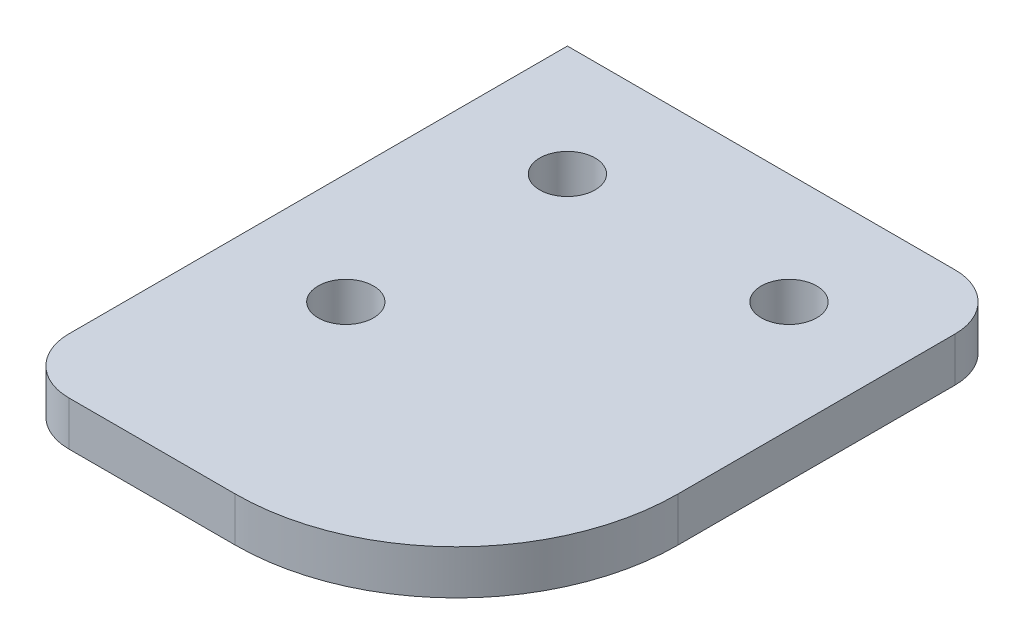
ISO-10303-21;
HEADER;
FILE_DESCRIPTION(('STEP AP214'),'2;1');
FILE_NAME('part.step','',(''),(''),'','','');
FILE_SCHEMA(('AUTOMOTIVE_DESIGN { 1 0 10303 214 1 1 1 1 }'));
ENDSEC;
DATA;
#1=APPLICATION_CONTEXT('core data for automotive mechanical design processes');
#2=APPLICATION_PROTOCOL_DEFINITION('international standard','automotive_design',2000,#1);
#3=PRODUCT_CONTEXT('',#1,'mechanical');
#4=PRODUCT('Part','Part','',(#3));
#5=PRODUCT_RELATED_PRODUCT_CATEGORY('part','',(#4));
#6=PRODUCT_DEFINITION_FORMATION('','',#4);
#7=PRODUCT_DEFINITION_CONTEXT('part definition',#1,'design');
#8=PRODUCT_DEFINITION('design','',#6,#7);
#9=PRODUCT_DEFINITION_SHAPE('','',#8);
#10=(LENGTH_UNIT() NAMED_UNIT(*) SI_UNIT(.MILLI.,.METRE.));
#11=(NAMED_UNIT(*) PLANE_ANGLE_UNIT() SI_UNIT($,.RADIAN.));
#12=(NAMED_UNIT(*) SI_UNIT($,.STERADIAN.) SOLID_ANGLE_UNIT());
#13=UNCERTAINTY_MEASURE_WITH_UNIT(LENGTH_MEASURE(1.E-05),#10,'distance_accuracy_value','');
#14=(GEOMETRIC_REPRESENTATION_CONTEXT(3) GLOBAL_UNCERTAINTY_ASSIGNED_CONTEXT((#13)) GLOBAL_UNIT_ASSIGNED_CONTEXT((#10,
#11,#12)) REPRESENTATION_CONTEXT('',''));
#15=CARTESIAN_POINT('',(0.,0.,0.));
#16=DIRECTION('',(0.,0.,1.));
#17=DIRECTION('',(1.,0.,0.));
#18=AXIS2_PLACEMENT_3D('',#15,#16,#17);
#19=CARTESIAN_POINT('',(0.,4.,10.));
#20=DIRECTION('',(0.,-1.,0.));
#21=DIRECTION('',(0.,0.,-1.));
#22=AXIS2_PLACEMENT_3D('',#19,#20,#21);
#23=PLANE('',#22);
#24=DIRECTION('',(0.,0.,-1.));
#25=VECTOR('',#24,1.);
#26=CARTESIAN_POINT('',(20.,4.,-20.));
#27=LINE('',#26,#25);
#28=CARTESIAN_POINT('',(20.,4.,10.));
#29=VERTEX_POINT('',#28);
#30=CARTESIAN_POINT('',(20.,4.,-15.));
#31=VERTEX_POINT('',#30);
#32=EDGE_CURVE('E129',#29,#31,#27,.T.);
#33=ORIENTED_EDGE('',*,*,#32,.T.);
#34=CARTESIAN_POINT('',(15.,4.,-15.));
#35=DIRECTION('',(0.,-1.,0.));
#36=DIRECTION('',(0.,0.,-1.));
#37=AXIS2_PLACEMENT_3D('',#34,#35,#36);
#38=CIRCLE('',#37,5.);
#39=CARTESIAN_POINT('',(15.,4.,-20.));
#40=VERTEX_POINT('',#39);
#41=EDGE_CURVE('E185',#31,#40,#38,.F.);
#42=ORIENTED_EDGE('',*,*,#41,.T.);
#43=DIRECTION('',(-1.,0.,0.));
#44=VECTOR('',#43,1.);
#45=CARTESIAN_POINT('',(-20.,4.,-20.));
#46=LINE('',#45,#44);
#47=CARTESIAN_POINT('',(-20.,4.,-20.));
#48=VERTEX_POINT('',#47);
#49=EDGE_CURVE('E131',#40,#48,#46,.T.);
#50=ORIENTED_EDGE('',*,*,#49,.T.);
#51=DIRECTION('',(0.,0.,1.));
#52=VECTOR('',#51,1.);
#53=CARTESIAN_POINT('',(-20.,4.,-20.));
#54=LINE('',#53,#52);
#55=CARTESIAN_POINT('',(-20.,4.,25.));
#56=VERTEX_POINT('',#55);
#57=EDGE_CURVE('E114',#48,#56,#54,.T.);
#58=ORIENTED_EDGE('',*,*,#57,.T.);
#59=CARTESIAN_POINT('',(-15.,4.,25.));
#60=DIRECTION('',(0.,-1.,0.));
#61=DIRECTION('',(0.,0.,-1.));
#62=AXIS2_PLACEMENT_3D('',#59,#60,#61);
#63=CIRCLE('',#62,5.);
#64=CARTESIAN_POINT('',(-15.,4.,30.));
#65=VERTEX_POINT('',#64);
#66=EDGE_CURVE('E62',#56,#65,#63,.F.);
#67=ORIENTED_EDGE('',*,*,#66,.T.);
#68=DIRECTION('',(1.,0.,0.));
#69=VECTOR('',#68,1.);
#70=CARTESIAN_POINT('',(-20.,4.,30.));
#71=LINE('',#70,#69);
#72=CARTESIAN_POINT('',(0.,4.,30.));
#73=VERTEX_POINT('',#72);
#74=EDGE_CURVE('E103',#65,#73,#71,.T.);
#75=ORIENTED_EDGE('',*,*,#74,.T.);
#76=CARTESIAN_POINT('',(0.,4.,10.));
#77=DIRECTION('',(0.,1.,0.));
#78=DIRECTION('',(0.,0.,-1.));
#79=AXIS2_PLACEMENT_3D('',#76,#77,#78);
#80=CIRCLE('',#79,20.);
#81=EDGE_CURVE('E109',#73,#29,#80,.T.);
#82=ORIENTED_EDGE('',*,*,#81,.T.);
#83=EDGE_LOOP('',(#33,#42,#50,#58,#67,#75,#82));
#84=FACE_BOUND('',#83,.T.);
#85=CARTESIAN_POINT('',(-9.99999999999999,4.,-9.99999999999999));
#86=DIRECTION('',(0.,1.,0.));
#87=DIRECTION('',(0.,0.,1.));
#88=AXIS2_PLACEMENT_3D('',#85,#86,#87);
#89=CIRCLE('',#88,2.5);
#90=CARTESIAN_POINT('',(-9.99999999999999,4.,-7.49999999999999));
#91=VERTEX_POINT('',#90);
#92=EDGE_CURVE('E141',#91,#91,#89,.T.);
#93=ORIENTED_EDGE('',*,*,#92,.F.);
#94=EDGE_LOOP('',(#93));
#95=FACE_BOUND('',#94,.T.);
#96=CARTESIAN_POINT('',(9.99999999999999,4.,-9.99999999999999));
#97=DIRECTION('',(0.,1.,0.));
#98=DIRECTION('',(0.,0.,-1.));
#99=AXIS2_PLACEMENT_3D('',#96,#97,#98);
#100=CIRCLE('',#99,2.5);
#101=CARTESIAN_POINT('',(9.99999999999999,4.,-12.5));
#102=VERTEX_POINT('',#101);
#103=EDGE_CURVE('E154',#102,#102,#100,.T.);
#104=ORIENTED_EDGE('',*,*,#103,.F.);
#105=EDGE_LOOP('',(#104));
#106=FACE_BOUND('',#105,.T.);
#107=CARTESIAN_POINT('',(-9.99999999999999,4.,9.99999999999999));
#108=DIRECTION('',(0.,1.,0.));
#109=DIRECTION('',(0.,0.,-1.));
#110=AXIS2_PLACEMENT_3D('',#107,#108,#109);
#111=CIRCLE('',#110,2.5);
#112=CARTESIAN_POINT('',(-9.99999999999999,4.,7.49999999999999));
#113=VERTEX_POINT('',#112);
#114=EDGE_CURVE('E155',#113,#113,#111,.T.);
#115=ORIENTED_EDGE('',*,*,#114,.F.);
#116=EDGE_LOOP('',(#115));
#117=FACE_BOUND('',#116,.T.);
#118=ADVANCED_FACE('F47',(#84,#95,#106,#117),#23,.F.);
#119=CARTESIAN_POINT('',(0.,0.,10.));
#120=DIRECTION('',(0.,-1.,0.));
#121=DIRECTION('',(0.,0.,-1.));
#122=AXIS2_PLACEMENT_3D('',#119,#120,#121);
#123=PLANE('',#122);
#124=CARTESIAN_POINT('',(9.99999999999999,0.,-9.99999999999999));
#125=DIRECTION('',(0.,1.,0.));
#126=DIRECTION('',(0.,0.,-1.));
#127=AXIS2_PLACEMENT_3D('',#124,#125,#126);
#128=CIRCLE('',#127,2.5);
#129=CARTESIAN_POINT('',(9.99999999999999,0.,-12.5));
#130=VERTEX_POINT('',#129);
#131=EDGE_CURVE('E148',#130,#130,#128,.T.);
#132=ORIENTED_EDGE('',*,*,#131,.T.);
#133=EDGE_LOOP('',(#132));
#134=FACE_BOUND('',#133,.T.);
#135=DIRECTION('',(-1.,0.,0.));
#136=VECTOR('',#135,1.);
#137=CARTESIAN_POINT('',(-20.,0.,-20.));
#138=LINE('',#137,#136);
#139=CARTESIAN_POINT('',(15.,0.,-20.));
#140=VERTEX_POINT('',#139);
#141=CARTESIAN_POINT('',(-20.,0.,-20.));
#142=VERTEX_POINT('',#141);
#143=EDGE_CURVE('E162',#140,#142,#138,.T.);
#144=ORIENTED_EDGE('',*,*,#143,.F.);
#145=CARTESIAN_POINT('',(15.,0.,-15.));
#146=DIRECTION('',(0.,-1.,0.));
#147=DIRECTION('',(0.,0.,-1.));
#148=AXIS2_PLACEMENT_3D('',#145,#146,#147);
#149=CIRCLE('',#148,5.);
#150=CARTESIAN_POINT('',(20.,0.,-15.));
#151=VERTEX_POINT('',#150);
#152=EDGE_CURVE('E180',#140,#151,#149,.T.);
#153=ORIENTED_EDGE('',*,*,#152,.T.);
#154=DIRECTION('',(0.,0.,-1.));
#155=VECTOR('',#154,1.);
#156=CARTESIAN_POINT('',(20.,0.,-20.));
#157=LINE('',#156,#155);
#158=CARTESIAN_POINT('',(20.,0.,10.));
#159=VERTEX_POINT('',#158);
#160=EDGE_CURVE('E163',#159,#151,#157,.T.);
#161=ORIENTED_EDGE('',*,*,#160,.F.);
#162=CARTESIAN_POINT('',(0.,0.,10.));
#163=DIRECTION('',(0.,1.,0.));
#164=DIRECTION('',(0.,0.,-1.));
#165=AXIS2_PLACEMENT_3D('',#162,#163,#164);
#166=CIRCLE('',#165,20.);
#167=CARTESIAN_POINT('',(0.,0.,30.));
#168=VERTEX_POINT('',#167);
#169=EDGE_CURVE('E171',#168,#159,#166,.T.);
#170=ORIENTED_EDGE('',*,*,#169,.F.);
#171=DIRECTION('',(1.,0.,0.));
#172=VECTOR('',#171,1.);
#173=CARTESIAN_POINT('',(-20.,0.,30.));
#174=LINE('',#173,#172);
#175=CARTESIAN_POINT('',(-15.,0.,30.));
#176=VERTEX_POINT('',#175);
#177=EDGE_CURVE('E120',#176,#168,#174,.T.);
#178=ORIENTED_EDGE('',*,*,#177,.F.);
#179=CARTESIAN_POINT('',(-15.,0.,25.));
#180=DIRECTION('',(0.,-1.,0.));
#181=DIRECTION('',(0.,0.,-1.));
#182=AXIS2_PLACEMENT_3D('',#179,#180,#181);
#183=CIRCLE('',#182,5.);
#184=CARTESIAN_POINT('',(-20.,0.,25.));
#185=VERTEX_POINT('',#184);
#186=EDGE_CURVE('E176',#176,#185,#183,.T.);
#187=ORIENTED_EDGE('',*,*,#186,.T.);
#188=DIRECTION('',(0.,0.,1.));
#189=VECTOR('',#188,1.);
#190=CARTESIAN_POINT('',(-20.,0.,-20.));
#191=LINE('',#190,#189);
#192=EDGE_CURVE('E137',#142,#185,#191,.T.);
#193=ORIENTED_EDGE('',*,*,#192,.F.);
#194=EDGE_LOOP('',(#144,#153,#161,#170,#178,#187,#193));
#195=FACE_BOUND('',#194,.T.);
#196=CARTESIAN_POINT('',(-9.99999999999999,0.,-9.99999999999999));
#197=DIRECTION('',(0.,1.,0.));
#198=DIRECTION('',(0.,0.,1.));
#199=AXIS2_PLACEMENT_3D('',#196,#197,#198);
#200=CIRCLE('',#199,2.5);
#201=CARTESIAN_POINT('',(-9.99999999999999,0.,-7.49999999999999));
#202=VERTEX_POINT('',#201);
#203=EDGE_CURVE('E158',#202,#202,#200,.T.);
#204=ORIENTED_EDGE('',*,*,#203,.T.);
#205=EDGE_LOOP('',(#204));
#206=FACE_BOUND('',#205,.T.);
#207=CARTESIAN_POINT('',(-9.99999999999999,0.,9.99999999999999));
#208=DIRECTION('',(0.,1.,0.));
#209=DIRECTION('',(0.,0.,-1.));
#210=AXIS2_PLACEMENT_3D('',#207,#208,#209);
#211=CIRCLE('',#210,2.5);
#212=CARTESIAN_POINT('',(-9.99999999999999,0.,7.49999999999999));
#213=VERTEX_POINT('',#212);
#214=EDGE_CURVE('E321',#213,#213,#211,.T.);
#215=ORIENTED_EDGE('',*,*,#214,.T.);
#216=EDGE_LOOP('',(#215));
#217=FACE_BOUND('',#216,.T.);
#218=ADVANCED_FACE('F188',(#134,#195,#206,#217),#123,.T.);
#219=CARTESIAN_POINT('',(-20.,4.,-20.));
#220=DIRECTION('',(1.,0.,0.));
#221=DIRECTION('',(0.,0.,-1.));
#222=AXIS2_PLACEMENT_3D('',#219,#220,#221);
#223=PLANE('',#222);
#224=ORIENTED_EDGE('',*,*,#192,.T.);
#225=DIRECTION('',(0.,-1.,0.));
#226=VECTOR('',#225,1.);
#227=CARTESIAN_POINT('',(-20.,4.,25.));
#228=LINE('',#227,#226);
#229=EDGE_CURVE('E12',#185,#56,#228,.F.);
#230=ORIENTED_EDGE('',*,*,#229,.T.);
#231=ORIENTED_EDGE('',*,*,#57,.F.);
#232=DIRECTION('',(0.,-1.,0.));
#233=VECTOR('',#232,1.);
#234=CARTESIAN_POINT('',(-20.,4.,-20.));
#235=LINE('',#234,#233);
#236=EDGE_CURVE('E136',#48,#142,#235,.T.);
#237=ORIENTED_EDGE('',*,*,#236,.T.);
#238=EDGE_LOOP('',(#224,#230,#231,#237));
#239=FACE_BOUND('',#238,.T.);
#240=ADVANCED_FACE('F201',(#239),#223,.F.);
#241=CARTESIAN_POINT('',(-20.,4.,30.));
#242=DIRECTION('',(0.,0.,-1.));
#243=DIRECTION('',(-1.,0.,0.));
#244=AXIS2_PLACEMENT_3D('',#241,#242,#243);
#245=PLANE('',#244);
#246=ORIENTED_EDGE('',*,*,#74,.F.);
#247=DIRECTION('',(0.,-1.,0.));
#248=VECTOR('',#247,1.);
#249=CARTESIAN_POINT('',(-15.,4.,30.));
#250=LINE('',#249,#248);
#251=EDGE_CURVE('E55',#65,#176,#250,.T.);
#252=ORIENTED_EDGE('',*,*,#251,.T.);
#253=ORIENTED_EDGE('',*,*,#177,.T.);
#254=DIRECTION('',(0.,-1.,0.));
#255=VECTOR('',#254,1.);
#256=CARTESIAN_POINT('',(0.,4.,30.));
#257=LINE('',#256,#255);
#258=EDGE_CURVE('E117',#73,#168,#257,.T.);
#259=ORIENTED_EDGE('',*,*,#258,.F.);
#260=EDGE_LOOP('',(#246,#252,#253,#259));
#261=FACE_BOUND('',#260,.T.);
#262=ADVANCED_FACE('F118',(#261),#245,.F.);
#263=CARTESIAN_POINT('',(0.,4.,10.));
#264=DIRECTION('',(0.,-1.,0.));
#265=DIRECTION('',(0.,0.,-1.));
#266=AXIS2_PLACEMENT_3D('',#263,#264,#265);
#267=CYLINDRICAL_SURFACE('',#266,20.);
#268=ORIENTED_EDGE('',*,*,#169,.T.);
#269=DIRECTION('',(0.,-1.,0.));
#270=VECTOR('',#269,1.);
#271=CARTESIAN_POINT('',(20.,4.,10.));
#272=LINE('',#271,#270);
#273=EDGE_CURVE('E124',#29,#159,#272,.T.);
#274=ORIENTED_EDGE('',*,*,#273,.F.);
#275=ORIENTED_EDGE('',*,*,#81,.F.);
#276=ORIENTED_EDGE('',*,*,#258,.T.);
#277=EDGE_LOOP('',(#268,#274,#275,#276));
#278=FACE_BOUND('',#277,.T.);
#279=ADVANCED_FACE('F126',(#278),#267,.T.);
#280=CARTESIAN_POINT('',(20.,4.,-20.));
#281=DIRECTION('',(-1.,0.,0.));
#282=DIRECTION('',(0.,0.,1.));
#283=AXIS2_PLACEMENT_3D('',#280,#281,#282);
#284=PLANE('',#283);
#285=ORIENTED_EDGE('',*,*,#160,.T.);
#286=DIRECTION('',(0.,-1.,0.));
#287=VECTOR('',#286,1.);
#288=CARTESIAN_POINT('',(20.,4.,-15.));
#289=LINE('',#288,#287);
#290=EDGE_CURVE('E182',#151,#31,#289,.F.);
#291=ORIENTED_EDGE('',*,*,#290,.T.);
#292=ORIENTED_EDGE('',*,*,#32,.F.);
#293=ORIENTED_EDGE('',*,*,#273,.T.);
#294=EDGE_LOOP('',(#285,#291,#292,#293));
#295=FACE_BOUND('',#294,.T.);
#296=ADVANCED_FACE('F193',(#295),#284,.F.);
#297=CARTESIAN_POINT('',(-20.,4.,-20.));
#298=DIRECTION('',(0.,0.,1.));
#299=DIRECTION('',(1.,0.,0.));
#300=AXIS2_PLACEMENT_3D('',#297,#298,#299);
#301=PLANE('',#300);
#302=ORIENTED_EDGE('',*,*,#49,.F.);
#303=DIRECTION('',(0.,-1.,0.));
#304=VECTOR('',#303,1.);
#305=CARTESIAN_POINT('',(15.,4.,-20.));
#306=LINE('',#305,#304);
#307=EDGE_CURVE('E123',#40,#140,#306,.T.);
#308=ORIENTED_EDGE('',*,*,#307,.T.);
#309=ORIENTED_EDGE('',*,*,#143,.T.);
#310=ORIENTED_EDGE('',*,*,#236,.F.);
#311=EDGE_LOOP('',(#302,#308,#309,#310));
#312=FACE_BOUND('',#311,.T.);
#313=ADVANCED_FACE('F200',(#312),#301,.F.);
#314=CARTESIAN_POINT('',(-9.99999999999999,4.,-9.99999999999999));
#315=DIRECTION('',(0.,-1.,0.));
#316=DIRECTION('',(0.,0.,-1.));
#317=AXIS2_PLACEMENT_3D('',#314,#315,#316);
#318=CYLINDRICAL_SURFACE('',#317,2.5);
#319=ORIENTED_EDGE('',*,*,#92,.T.);
#320=EDGE_LOOP('',(#319));
#321=FACE_BOUND('',#320,.T.);
#322=ORIENTED_EDGE('',*,*,#203,.F.);
#323=EDGE_LOOP('',(#322));
#324=FACE_BOUND('',#323,.T.);
#325=ADVANCED_FACE('F216',(#321,#324),#318,.F.);
#326=CARTESIAN_POINT('',(9.99999999999999,4.,-9.99999999999999));
#327=DIRECTION('',(0.,-1.,0.));
#328=DIRECTION('',(0.,0.,-1.));
#329=AXIS2_PLACEMENT_3D('',#326,#327,#328);
#330=CYLINDRICAL_SURFACE('',#329,2.5);
#331=ORIENTED_EDGE('',*,*,#103,.T.);
#332=EDGE_LOOP('',(#331));
#333=FACE_BOUND('',#332,.T.);
#334=ORIENTED_EDGE('',*,*,#131,.F.);
#335=EDGE_LOOP('',(#334));
#336=FACE_BOUND('',#335,.T.);
#337=ADVANCED_FACE('F243',(#333,#336),#330,.F.);
#338=CARTESIAN_POINT('',(-9.99999999999999,4.,9.99999999999999));
#339=DIRECTION('',(0.,-1.,0.));
#340=DIRECTION('',(0.,0.,-1.));
#341=AXIS2_PLACEMENT_3D('',#338,#339,#340);
#342=CYLINDRICAL_SURFACE('',#341,2.5);
#343=ORIENTED_EDGE('',*,*,#114,.T.);
#344=EDGE_LOOP('',(#343));
#345=FACE_BOUND('',#344,.T.);
#346=ORIENTED_EDGE('',*,*,#214,.F.);
#347=EDGE_LOOP('',(#346));
#348=FACE_BOUND('',#347,.T.);
#349=ADVANCED_FACE('F250',(#345,#348),#342,.F.);
#350=CARTESIAN_POINT('',(15.,4.,-15.));
#351=DIRECTION('',(0.,-1.,0.));
#352=DIRECTION('',(0.,0.,-1.));
#353=AXIS2_PLACEMENT_3D('',#350,#351,#352);
#354=CYLINDRICAL_SURFACE('',#353,5.);
#355=ORIENTED_EDGE('',*,*,#41,.F.);
#356=ORIENTED_EDGE('',*,*,#290,.F.);
#357=ORIENTED_EDGE('',*,*,#152,.F.);
#358=ORIENTED_EDGE('',*,*,#307,.F.);
#359=EDGE_LOOP('',(#355,#356,#357,#358));
#360=FACE_BOUND('',#359,.T.);
#361=ADVANCED_FACE('F198',(#360),#354,.T.);
#362=CARTESIAN_POINT('',(-15.,4.,25.));
#363=DIRECTION('',(0.,-1.,0.));
#364=DIRECTION('',(0.,0.,-1.));
#365=AXIS2_PLACEMENT_3D('',#362,#363,#364);
#366=CYLINDRICAL_SURFACE('',#365,5.);
#367=ORIENTED_EDGE('',*,*,#66,.F.);
#368=ORIENTED_EDGE('',*,*,#229,.F.);
#369=ORIENTED_EDGE('',*,*,#186,.F.);
#370=ORIENTED_EDGE('',*,*,#251,.F.);
#371=EDGE_LOOP('',(#367,#368,#369,#370));
#372=FACE_BOUND('',#371,.T.);
#373=ADVANCED_FACE('F49',(#372),#366,.T.);
#374=CLOSED_SHELL('',(#118,#218,#240,#262,#279,#296,#313,#325,#337,#349,#361,#373));
#375=MANIFOLD_SOLID_BREP('B2',#374);
#376=ADVANCED_BREP_SHAPE_REPRESENTATION('',(#18,#375),#14);
#377=SHAPE_DEFINITION_REPRESENTATION(#9,#376);
ENDSEC;
END-ISO-10303-21;
